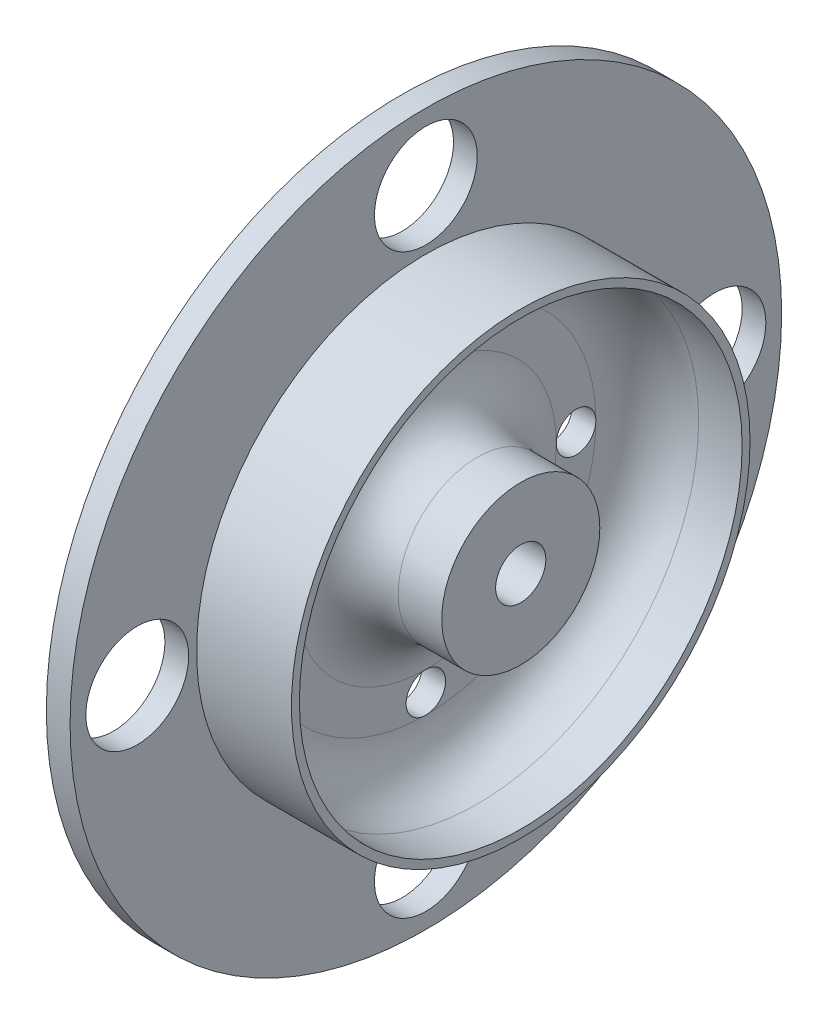
ISO-10303-21;
HEADER;
FILE_DESCRIPTION(('STEP AP214'),'2;1');
FILE_NAME('part.step','',(''),(''),'','','');
FILE_SCHEMA(('AUTOMOTIVE_DESIGN { 1 0 10303 214 1 1 1 1 }'));
ENDSEC;
DATA;
#1=APPLICATION_CONTEXT('core data for automotive mechanical design processes');
#2=APPLICATION_PROTOCOL_DEFINITION('international standard','automotive_design',2000,#1);
#3=PRODUCT_CONTEXT('',#1,'mechanical');
#4=PRODUCT('Part','Part','',(#3));
#5=PRODUCT_RELATED_PRODUCT_CATEGORY('part','',(#4));
#6=PRODUCT_DEFINITION_FORMATION('','',#4);
#7=PRODUCT_DEFINITION_CONTEXT('part definition',#1,'design');
#8=PRODUCT_DEFINITION('design','',#6,#7);
#9=PRODUCT_DEFINITION_SHAPE('','',#8);
#10=(LENGTH_UNIT() NAMED_UNIT(*) SI_UNIT(.MILLI.,.METRE.));
#11=(NAMED_UNIT(*) PLANE_ANGLE_UNIT() SI_UNIT($,.RADIAN.));
#12=(NAMED_UNIT(*) SI_UNIT($,.STERADIAN.) SOLID_ANGLE_UNIT());
#13=UNCERTAINTY_MEASURE_WITH_UNIT(LENGTH_MEASURE(1.E-05),#10,'distance_accuracy_value','');
#14=(GEOMETRIC_REPRESENTATION_CONTEXT(3) GLOBAL_UNCERTAINTY_ASSIGNED_CONTEXT((#13)) GLOBAL_UNIT_ASSIGNED_CONTEXT((#10,
#11,#12)) REPRESENTATION_CONTEXT('',''));
#15=CARTESIAN_POINT('',(0.,0.,0.));
#16=DIRECTION('',(0.,0.,1.));
#17=DIRECTION('',(1.,0.,0.));
#18=AXIS2_PLACEMENT_3D('',#15,#16,#17);
#19=CARTESIAN_POINT('',(3.0475130098464,0.,0.));
#20=DIRECTION('',(1.,0.,0.));
#21=DIRECTION('',(0.,0.,-1.));
#22=AXIS2_PLACEMENT_3D('',#19,#20,#21);
#23=PLANE('',#22);
#24=CARTESIAN_POINT('',(3.0475130098464,0.,16.8888888888889));
#25=DIRECTION('',(1.,0.,0.));
#26=DIRECTION('',(0.,0.,-1.));
#27=AXIS2_PLACEMENT_3D('',#24,#25,#26);
#28=CIRCLE('',#27,2.22222222222222);
#29=CARTESIAN_POINT('',(3.0475130098464,0.,14.6666666666667));
#30=VERTEX_POINT('',#29);
#31=CARTESIAN_POINT('',(3.0475130098464,0.,19.1111111111111));
#32=VERTEX_POINT('',#31);
#33=EDGE_CURVE('E55',#30,#32,#28,.T.);
#34=ORIENTED_EDGE('',*,*,#33,.F.);
#35=CARTESIAN_POINT('',(3.0475130098464,0.,0.));
#36=DIRECTION('',(1.,0.,0.));
#37=DIRECTION('',(0.,0.,-1.));
#38=AXIS2_PLACEMENT_3D('',#35,#36,#37);
#39=CIRCLE('',#38,14.6666666666667);
#40=CARTESIAN_POINT('',(3.0475130098464,14.6666666666667,0.));
#41=VERTEX_POINT('',#40);
#42=EDGE_CURVE('E89',#30,#41,#39,.F.);
#43=ORIENTED_EDGE('',*,*,#42,.T.);
#44=CARTESIAN_POINT('',(3.0475130098464,16.8888888888889,0.));
#45=DIRECTION('',(1.,0.,0.));
#46=DIRECTION('',(0.,0.,-1.));
#47=AXIS2_PLACEMENT_3D('',#44,#45,#46);
#48=CIRCLE('',#47,2.22222222222222);
#49=CARTESIAN_POINT('',(3.0475130098464,19.1111111111111,0.));
#50=VERTEX_POINT('',#49);
#51=EDGE_CURVE('E185',#50,#41,#48,.T.);
#52=ORIENTED_EDGE('',*,*,#51,.F.);
#53=CARTESIAN_POINT('',(3.0475130098464,0.,0.));
#54=DIRECTION('',(1.,0.,0.));
#55=DIRECTION('',(0.,0.,-1.));
#56=AXIS2_PLACEMENT_3D('',#53,#54,#55);
#57=CIRCLE('',#56,19.1111111111111);
#58=EDGE_CURVE('E92',#50,#32,#57,.T.);
#59=ORIENTED_EDGE('',*,*,#58,.T.);
#60=EDGE_LOOP('',(#34,#43,#52,#59));
#61=FACE_BOUND('',#60,.T.);
#62=ADVANCED_FACE('F40',(#61),#23,.T.);
#63=EDGE_CURVE('E80',#32,#30,#28,.T.);
#64=ORIENTED_EDGE('',*,*,#63,.F.);
#65=CARTESIAN_POINT('',(3.0475130098464,-19.1111111111111,0.));
#66=VERTEX_POINT('',#65);
#67=EDGE_CURVE('E62',#32,#66,#57,.T.);
#68=ORIENTED_EDGE('',*,*,#67,.T.);
#69=CARTESIAN_POINT('',(3.0475130098464,-16.8888888888889,0.));
#70=DIRECTION('',(1.,0.,0.));
#71=DIRECTION('',(0.,0.,-1.));
#72=AXIS2_PLACEMENT_3D('',#69,#70,#71);
#73=CIRCLE('',#72,2.22222222222222);
#74=CARTESIAN_POINT('',(3.0475130098464,-14.6666666666667,0.));
#75=VERTEX_POINT('',#74);
#76=EDGE_CURVE('E106',#75,#66,#73,.T.);
#77=ORIENTED_EDGE('',*,*,#76,.F.);
#78=EDGE_CURVE('E101',#75,#30,#39,.F.);
#79=ORIENTED_EDGE('',*,*,#78,.T.);
#80=EDGE_LOOP('',(#64,#68,#77,#79));
#81=FACE_BOUND('',#80,.T.);
#82=ADVANCED_FACE('F105',(#81),#23,.T.);
#83=CARTESIAN_POINT('',(3.0475130098464,0.,-16.8888888888889));
#84=DIRECTION('',(1.,0.,0.));
#85=DIRECTION('',(0.,0.,-1.));
#86=AXIS2_PLACEMENT_3D('',#83,#84,#85);
#87=CIRCLE('',#86,2.22222222222222);
#88=CARTESIAN_POINT('',(3.0475130098464,0.,-19.1111111111111));
#89=VERTEX_POINT('',#88);
#90=CARTESIAN_POINT('',(3.0475130098464,0.,-14.6666666666667));
#91=VERTEX_POINT('',#90);
#92=EDGE_CURVE('E192',#89,#91,#87,.T.);
#93=ORIENTED_EDGE('',*,*,#92,.F.);
#94=EDGE_CURVE('E115',#89,#50,#57,.T.);
#95=ORIENTED_EDGE('',*,*,#94,.T.);
#96=EDGE_CURVE('E188',#41,#50,#48,.T.);
#97=ORIENTED_EDGE('',*,*,#96,.F.);
#98=EDGE_CURVE('E49',#41,#91,#39,.F.);
#99=ORIENTED_EDGE('',*,*,#98,.T.);
#100=EDGE_LOOP('',(#93,#95,#97,#99));
#101=FACE_BOUND('',#100,.T.);
#102=ADVANCED_FACE('F230',(#101),#23,.T.);
#103=CARTESIAN_POINT('',(3.0475130098464,0.,0.));
#104=DIRECTION('',(-1.,0.,0.));
#105=DIRECTION('',(0.,0.,1.));
#106=AXIS2_PLACEMENT_3D('',#103,#104,#105);
#107=CYLINDRICAL_SURFACE('',#106,40.);
#108=CARTESIAN_POINT('',(3.0475130098464,0.,0.));
#109=DIRECTION('',(1.,0.,0.));
#110=DIRECTION('',(0.,0.,-1.));
#111=AXIS2_PLACEMENT_3D('',#108,#109,#110);
#112=CIRCLE('',#111,40.);
#113=CARTESIAN_POINT('',(3.0475130098464,0.,-40.));
#114=VERTEX_POINT('',#113);
#115=EDGE_CURVE('E120',#114,#114,#112,.T.);
#116=ORIENTED_EDGE('',*,*,#115,.F.);
#117=EDGE_LOOP('',(#116));
#118=FACE_BOUND('',#117,.T.);
#119=CARTESIAN_POINT('',(0.380846343179729,0.,0.));
#120=DIRECTION('',(1.,0.,0.));
#121=DIRECTION('',(0.,0.,-1.));
#122=AXIS2_PLACEMENT_3D('',#119,#120,#121);
#123=CIRCLE('',#122,40.);
#124=CARTESIAN_POINT('',(0.380846343179729,0.,-40.));
#125=VERTEX_POINT('',#124);
#126=EDGE_CURVE('E121',#125,#125,#123,.T.);
#127=ORIENTED_EDGE('',*,*,#126,.T.);
#128=EDGE_LOOP('',(#127));
#129=FACE_BOUND('',#128,.T.);
#130=ADVANCED_FACE('F260',(#118,#129),#107,.T.);
#131=CARTESIAN_POINT('',(3.0475130098464,0.,32.4444444444444));
#132=DIRECTION('',(1.,0.,0.));
#133=DIRECTION('',(0.,0.,-1.));
#134=AXIS2_PLACEMENT_3D('',#131,#132,#133);
#135=CIRCLE('',#134,5.77777777777778);
#136=CARTESIAN_POINT('',(3.0475130098464,0.,26.6666666666667));
#137=VERTEX_POINT('',#136);
#138=EDGE_CURVE('E177',#137,#137,#135,.T.);
#139=ORIENTED_EDGE('',*,*,#138,.F.);
#140=EDGE_LOOP('',(#139));
#141=FACE_BOUND('',#140,.T.);
#142=CARTESIAN_POINT('',(3.0475130098464,-32.4444444444444,0.));
#143=DIRECTION('',(1.,0.,0.));
#144=DIRECTION('',(0.,0.,-1.));
#145=AXIS2_PLACEMENT_3D('',#142,#143,#144);
#146=CIRCLE('',#145,5.77777777777778);
#147=CARTESIAN_POINT('',(3.0475130098464,-32.4444444444444,-5.77777777777779));
#148=VERTEX_POINT('',#147);
#149=EDGE_CURVE('E169',#148,#148,#146,.T.);
#150=ORIENTED_EDGE('',*,*,#149,.F.);
#151=EDGE_LOOP('',(#150));
#152=FACE_BOUND('',#151,.T.);
#153=CARTESIAN_POINT('',(3.0475130098464,0.,-32.4444444444444));
#154=DIRECTION('',(1.,0.,0.));
#155=DIRECTION('',(0.,0.,-1.));
#156=AXIS2_PLACEMENT_3D('',#153,#154,#155);
#157=CIRCLE('',#156,5.77777777777778);
#158=CARTESIAN_POINT('',(3.0475130098464,0.,-38.2222222222222));
#159=VERTEX_POINT('',#158);
#160=EDGE_CURVE('E161',#159,#159,#157,.T.);
#161=ORIENTED_EDGE('',*,*,#160,.F.);
#162=EDGE_LOOP('',(#161));
#163=FACE_BOUND('',#162,.T.);
#164=CARTESIAN_POINT('',(3.0475130098464,32.4444444444444,0.));
#165=DIRECTION('',(1.,0.,0.));
#166=DIRECTION('',(0.,0.,-1.));
#167=AXIS2_PLACEMENT_3D('',#164,#165,#166);
#168=CIRCLE('',#167,5.77777777777778);
#169=CARTESIAN_POINT('',(3.0475130098464,32.4444444444444,-5.77777777777778));
#170=VERTEX_POINT('',#169);
#171=EDGE_CURVE('E153',#170,#170,#168,.T.);
#172=ORIENTED_EDGE('',*,*,#171,.F.);
#173=EDGE_LOOP('',(#172));
#174=FACE_BOUND('',#173,.T.);
#175=CARTESIAN_POINT('',(3.0475130098464,0.,0.));
#176=DIRECTION('',(1.,0.,0.));
#177=DIRECTION('',(0.,0.,-1.));
#178=AXIS2_PLACEMENT_3D('',#175,#176,#177);
#179=CIRCLE('',#178,25.7777777777778);
#180=CARTESIAN_POINT('',(3.0475130098464,0.,-25.7777777777778));
#181=VERTEX_POINT('',#180);
#182=EDGE_CURVE('E133',#181,#181,#179,.T.);
#183=ORIENTED_EDGE('',*,*,#182,.F.);
#184=EDGE_LOOP('',(#183));
#185=FACE_BOUND('',#184,.T.);
#186=ORIENTED_EDGE('',*,*,#115,.T.);
#187=EDGE_LOOP('',(#186));
#188=FACE_BOUND('',#187,.T.);
#189=ADVANCED_FACE('F252',(#141,#152,#163,#174,#185,#188),#23,.T.);
#190=CARTESIAN_POINT('',(0.380846343179729,0.,0.));
#191=DIRECTION('',(1.,0.,0.));
#192=DIRECTION('',(0.,0.,-1.));
#193=AXIS2_PLACEMENT_3D('',#190,#191,#192);
#194=PLANE('',#193);
#195=CARTESIAN_POINT('',(0.380846343179729,0.,16.8888888888889));
#196=DIRECTION('',(1.,0.,0.));
#197=DIRECTION('',(0.,0.,-1.));
#198=AXIS2_PLACEMENT_3D('',#195,#196,#197);
#199=CIRCLE('',#198,2.22222222222222);
#200=CARTESIAN_POINT('',(0.380846343179729,0.,14.6666666666667));
#201=VERTEX_POINT('',#200);
#202=EDGE_CURVE('E94',#201,#201,#199,.T.);
#203=ORIENTED_EDGE('',*,*,#202,.T.);
#204=EDGE_LOOP('',(#203));
#205=FACE_BOUND('',#204,.T.);
#206=CARTESIAN_POINT('',(0.380846343179729,-16.8888888888889,0.));
#207=DIRECTION('',(1.,0.,0.));
#208=DIRECTION('',(0.,0.,-1.));
#209=AXIS2_PLACEMENT_3D('',#206,#207,#208);
#210=CIRCLE('',#209,2.22222222222222);
#211=CARTESIAN_POINT('',(0.380846343179729,-16.8888888888889,-2.22222222222223));
#212=VERTEX_POINT('',#211);
#213=EDGE_CURVE('E201',#212,#212,#210,.T.);
#214=ORIENTED_EDGE('',*,*,#213,.T.);
#215=EDGE_LOOP('',(#214));
#216=FACE_BOUND('',#215,.T.);
#217=CARTESIAN_POINT('',(0.380846343179729,0.,-16.8888888888889));
#218=DIRECTION('',(1.,0.,0.));
#219=DIRECTION('',(0.,0.,-1.));
#220=AXIS2_PLACEMENT_3D('',#217,#218,#219);
#221=CIRCLE('',#220,2.22222222222222);
#222=CARTESIAN_POINT('',(0.380846343179729,0.,-19.1111111111111));
#223=VERTEX_POINT('',#222);
#224=EDGE_CURVE('E195',#223,#223,#221,.T.);
#225=ORIENTED_EDGE('',*,*,#224,.T.);
#226=EDGE_LOOP('',(#225));
#227=FACE_BOUND('',#226,.T.);
#228=CARTESIAN_POINT('',(0.380846343179729,16.8888888888889,0.));
#229=DIRECTION('',(1.,0.,0.));
#230=DIRECTION('',(0.,0.,-1.));
#231=AXIS2_PLACEMENT_3D('',#228,#229,#230);
#232=CIRCLE('',#231,2.22222222222222);
#233=CARTESIAN_POINT('',(0.380846343179729,16.8888888888889,-2.22222222222222));
#234=VERTEX_POINT('',#233);
#235=EDGE_CURVE('E181',#234,#234,#232,.T.);
#236=ORIENTED_EDGE('',*,*,#235,.T.);
#237=EDGE_LOOP('',(#236));
#238=FACE_BOUND('',#237,.T.);
#239=CARTESIAN_POINT('',(0.380846343179729,0.,32.4444444444444));
#240=DIRECTION('',(1.,0.,0.));
#241=DIRECTION('',(0.,0.,-1.));
#242=AXIS2_PLACEMENT_3D('',#239,#240,#241);
#243=CIRCLE('',#242,5.77777777777778);
#244=CARTESIAN_POINT('',(0.380846343179729,0.,26.6666666666667));
#245=VERTEX_POINT('',#244);
#246=EDGE_CURVE('E173',#245,#245,#243,.T.);
#247=ORIENTED_EDGE('',*,*,#246,.T.);
#248=EDGE_LOOP('',(#247));
#249=FACE_BOUND('',#248,.T.);
#250=CARTESIAN_POINT('',(0.380846343179729,-32.4444444444444,0.));
#251=DIRECTION('',(1.,0.,0.));
#252=DIRECTION('',(0.,0.,-1.));
#253=AXIS2_PLACEMENT_3D('',#250,#251,#252);
#254=CIRCLE('',#253,5.77777777777778);
#255=CARTESIAN_POINT('',(0.380846343179729,-32.4444444444444,-5.77777777777779));
#256=VERTEX_POINT('',#255);
#257=EDGE_CURVE('E165',#256,#256,#254,.T.);
#258=ORIENTED_EDGE('',*,*,#257,.T.);
#259=EDGE_LOOP('',(#258));
#260=FACE_BOUND('',#259,.T.);
#261=CARTESIAN_POINT('',(0.380846343179729,0.,-32.4444444444444));
#262=DIRECTION('',(1.,0.,0.));
#263=DIRECTION('',(0.,0.,-1.));
#264=AXIS2_PLACEMENT_3D('',#261,#262,#263);
#265=CIRCLE('',#264,5.77777777777778);
#266=CARTESIAN_POINT('',(0.380846343179729,0.,-38.2222222222222));
#267=VERTEX_POINT('',#266);
#268=EDGE_CURVE('E157',#267,#267,#265,.T.);
#269=ORIENTED_EDGE('',*,*,#268,.T.);
#270=EDGE_LOOP('',(#269));
#271=FACE_BOUND('',#270,.T.);
#272=CARTESIAN_POINT('',(0.380846343179729,32.4444444444444,0.));
#273=DIRECTION('',(1.,0.,0.));
#274=DIRECTION('',(0.,0.,-1.));
#275=AXIS2_PLACEMENT_3D('',#272,#273,#274);
#276=CIRCLE('',#275,5.77777777777778);
#277=CARTESIAN_POINT('',(0.380846343179729,32.4444444444444,-5.77777777777778));
#278=VERTEX_POINT('',#277);
#279=EDGE_CURVE('E152',#278,#278,#276,.T.);
#280=ORIENTED_EDGE('',*,*,#279,.T.);
#281=EDGE_LOOP('',(#280));
#282=FACE_BOUND('',#281,.T.);
#283=CARTESIAN_POINT('',(0.380846343179729,0.,0.));
#284=DIRECTION('',(1.,0.,0.));
#285=DIRECTION('',(0.,0.,-1.));
#286=AXIS2_PLACEMENT_3D('',#283,#284,#285);
#287=CIRCLE('',#286,2.82222222222222);
#288=CARTESIAN_POINT('',(0.380846343179729,0.,-2.82222222222222));
#289=VERTEX_POINT('',#288);
#290=EDGE_CURVE('E144',#289,#289,#287,.F.);
#291=ORIENTED_EDGE('',*,*,#290,.F.);
#292=EDGE_LOOP('',(#291));
#293=FACE_BOUND('',#292,.T.);
#294=ORIENTED_EDGE('',*,*,#126,.F.);
#295=EDGE_LOOP('',(#294));
#296=FACE_BOUND('',#295,.T.);
#297=ADVANCED_FACE('F259',(#205,#216,#227,#238,#249,#260,#271,#282,#293,#296),#194,.F.);
#298=CARTESIAN_POINT('',(13.7141796765131,0.,0.));
#299=DIRECTION('',(1.,0.,0.));
#300=DIRECTION('',(0.,0.,-1.));
#301=AXIS2_PLACEMENT_3D('',#298,#299,#300);
#302=PLANE('',#301);
#303=CARTESIAN_POINT('',(13.7141796765131,0.,0.));
#304=DIRECTION('',(1.,0.,0.));
#305=DIRECTION('',(0.,0.,-1.));
#306=AXIS2_PLACEMENT_3D('',#303,#304,#305);
#307=CIRCLE('',#306,25.7777777777778);
#308=CARTESIAN_POINT('',(13.7141796765131,0.,-25.7777777777778));
#309=VERTEX_POINT('',#308);
#310=EDGE_CURVE('E132',#309,#309,#307,.T.);
#311=ORIENTED_EDGE('',*,*,#310,.T.);
#312=EDGE_LOOP('',(#311));
#313=FACE_BOUND('',#312,.T.);
#314=CARTESIAN_POINT('',(13.7141796765131,0.,0.));
#315=DIRECTION('',(1.,0.,0.));
#316=DIRECTION('',(0.,0.,-1.));
#317=AXIS2_PLACEMENT_3D('',#314,#315,#316);
#318=CIRCLE('',#317,24.8888888888889);
#319=CARTESIAN_POINT('',(13.7141796765131,0.,-24.8888888888889));
#320=VERTEX_POINT('',#319);
#321=EDGE_CURVE('E137',#320,#320,#318,.T.);
#322=ORIENTED_EDGE('',*,*,#321,.F.);
#323=EDGE_LOOP('',(#322));
#324=FACE_BOUND('',#323,.T.);
#325=ADVANCED_FACE('F266',(#313,#324),#302,.T.);
#326=CARTESIAN_POINT('',(13.7141796765131,0.,0.));
#327=DIRECTION('',(-1.,0.,0.));
#328=DIRECTION('',(0.,0.,1.));
#329=AXIS2_PLACEMENT_3D('',#326,#327,#328);
#330=CYLINDRICAL_SURFACE('',#329,25.7777777777778);
#331=ORIENTED_EDGE('',*,*,#310,.F.);
#332=EDGE_LOOP('',(#331));
#333=FACE_BOUND('',#332,.T.);
#334=ORIENTED_EDGE('',*,*,#182,.T.);
#335=EDGE_LOOP('',(#334));
#336=FACE_BOUND('',#335,.T.);
#337=ADVANCED_FACE('F305',(#333,#336),#330,.T.);
#338=CARTESIAN_POINT('',(13.7141796765131,0.,0.));
#339=DIRECTION('',(-1.,0.,0.));
#340=DIRECTION('',(0.,0.,1.));
#341=AXIS2_PLACEMENT_3D('',#338,#339,#340);
#342=CYLINDRICAL_SURFACE('',#341,24.8888888888889);
#343=CARTESIAN_POINT('',(8.82529078762417,0.,0.));
#344=DIRECTION('',(1.,0.,0.));
#345=DIRECTION('',(0.,0.,-1.));
#346=AXIS2_PLACEMENT_3D('',#343,#344,#345);
#347=CIRCLE('',#346,24.8888888888889);
#348=CARTESIAN_POINT('',(8.82529078762417,0.,-24.8888888888889));
#349=VERTEX_POINT('',#348);
#350=EDGE_CURVE('E11',#349,#349,#347,.F.);
#351=ORIENTED_EDGE('',*,*,#350,.T.);
#352=EDGE_LOOP('',(#351));
#353=FACE_BOUND('',#352,.T.);
#354=ORIENTED_EDGE('',*,*,#321,.T.);
#355=EDGE_LOOP('',(#354));
#356=FACE_BOUND('',#355,.T.);
#357=ADVANCED_FACE('F314',(#353,#356),#342,.F.);
#358=CARTESIAN_POINT('',(13.7141796765131,0.,0.));
#359=DIRECTION('',(1.,0.,0.));
#360=DIRECTION('',(0.,0.,-1.));
#361=AXIS2_PLACEMENT_3D('',#358,#359,#360);
#362=PLANE('',#361);
#363=CARTESIAN_POINT('',(13.7141796765131,0.,0.));
#364=DIRECTION('',(1.,0.,0.));
#365=DIRECTION('',(0.,0.,-1.));
#366=AXIS2_PLACEMENT_3D('',#363,#364,#365);
#367=CIRCLE('',#366,2.82222222222222);
#368=CARTESIAN_POINT('',(13.7141796765131,0.,-2.82222222222222));
#369=VERTEX_POINT('',#368);
#370=EDGE_CURVE('E148',#369,#369,#367,.T.);
#371=ORIENTED_EDGE('',*,*,#370,.F.);
#372=EDGE_LOOP('',(#371));
#373=FACE_BOUND('',#372,.T.);
#374=CARTESIAN_POINT('',(13.7141796765131,0.,0.));
#375=DIRECTION('',(1.,0.,0.));
#376=DIRECTION('',(0.,0.,-1.));
#377=AXIS2_PLACEMENT_3D('',#374,#375,#376);
#378=CIRCLE('',#377,8.88888888888889);
#379=CARTESIAN_POINT('',(13.7141796765131,0.,-8.88888888888889));
#380=VERTEX_POINT('',#379);
#381=EDGE_CURVE('E125',#380,#380,#378,.T.);
#382=ORIENTED_EDGE('',*,*,#381,.T.);
#383=EDGE_LOOP('',(#382));
#384=FACE_BOUND('',#383,.T.);
#385=ADVANCED_FACE('F280',(#373,#384),#362,.T.);
#386=CARTESIAN_POINT('',(13.7141796765131,0.,0.));
#387=DIRECTION('',(-1.,0.,0.));
#388=DIRECTION('',(0.,0.,1.));
#389=AXIS2_PLACEMENT_3D('',#386,#387,#388);
#390=CYLINDRICAL_SURFACE('',#389,8.88888888888889);
#391=CARTESIAN_POINT('',(8.82529078762417,0.,0.));
#392=DIRECTION('',(1.,0.,0.));
#393=DIRECTION('',(0.,0.,-1.));
#394=AXIS2_PLACEMENT_3D('',#391,#392,#393);
#395=CIRCLE('',#394,8.88888888888889);
#396=CARTESIAN_POINT('',(8.82529078762417,0.,-8.88888888888889));
#397=VERTEX_POINT('',#396);
#398=EDGE_CURVE('E116',#397,#397,#395,.T.);
#399=ORIENTED_EDGE('',*,*,#398,.T.);
#400=EDGE_LOOP('',(#399));
#401=FACE_BOUND('',#400,.T.);
#402=ORIENTED_EDGE('',*,*,#381,.F.);
#403=EDGE_LOOP('',(#402));
#404=FACE_BOUND('',#403,.T.);
#405=ADVANCED_FACE('F273',(#401,#404),#390,.T.);
#406=EDGE_CURVE('E202',#66,#75,#73,.T.);
#407=ORIENTED_EDGE('',*,*,#406,.F.);
#408=EDGE_CURVE('E218',#66,#89,#57,.T.);
#409=ORIENTED_EDGE('',*,*,#408,.T.);
#410=EDGE_CURVE('E196',#91,#89,#87,.T.);
#411=ORIENTED_EDGE('',*,*,#410,.F.);
#412=EDGE_CURVE('E108',#91,#75,#39,.F.);
#413=ORIENTED_EDGE('',*,*,#412,.T.);
#414=EDGE_LOOP('',(#407,#409,#411,#413));
#415=FACE_BOUND('',#414,.T.);
#416=ADVANCED_FACE('F216',(#415),#23,.T.);
#417=CARTESIAN_POINT('',(-7.60160354221507,0.,0.));
#418=DIRECTION('',(1.,0.,0.));
#419=DIRECTION('',(0.,0.,-1.));
#420=AXIS2_PLACEMENT_3D('',#417,#418,#419);
#421=CYLINDRICAL_SURFACE('',#420,2.82222222222222);
#422=ORIENTED_EDGE('',*,*,#290,.T.);
#423=EDGE_LOOP('',(#422));
#424=FACE_BOUND('',#423,.T.);
#425=ORIENTED_EDGE('',*,*,#370,.T.);
#426=EDGE_LOOP('',(#425));
#427=FACE_BOUND('',#426,.T.);
#428=ADVANCED_FACE('F272',(#424,#427),#421,.F.);
#429=CARTESIAN_POINT('',(8.82529078762417,0.,0.));
#430=DIRECTION('',(1.,0.,0.));
#431=DIRECTION('',(0.,0.,-1.));
#432=AXIS2_PLACEMENT_3D('',#429,#430,#431);
#433=TOROIDAL_SURFACE('',#432,14.6666666666667,5.77777777777778);
#434=ORIENTED_EDGE('',*,*,#98,.F.);
#435=ORIENTED_EDGE('',*,*,#42,.F.);
#436=ORIENTED_EDGE('',*,*,#78,.F.);
#437=ORIENTED_EDGE('',*,*,#412,.F.);
#438=EDGE_LOOP('',(#434,#435,#436,#437));
#439=FACE_BOUND('',#438,.T.);
#440=ORIENTED_EDGE('',*,*,#398,.F.);
#441=EDGE_LOOP('',(#440));
#442=FACE_BOUND('',#441,.T.);
#443=ADVANCED_FACE('F98',(#439,#442),#433,.F.);
#444=CARTESIAN_POINT('',(8.82529078762417,0.,0.));
#445=DIRECTION('',(1.,0.,0.));
#446=DIRECTION('',(0.,0.,-1.));
#447=AXIS2_PLACEMENT_3D('',#444,#445,#446);
#448=TOROIDAL_SURFACE('',#447,19.1111111111111,5.77777777777778);
#449=ORIENTED_EDGE('',*,*,#58,.F.);
#450=ORIENTED_EDGE('',*,*,#94,.F.);
#451=ORIENTED_EDGE('',*,*,#408,.F.);
#452=ORIENTED_EDGE('',*,*,#67,.F.);
#453=EDGE_LOOP('',(#449,#450,#451,#452));
#454=FACE_BOUND('',#453,.T.);
#455=ORIENTED_EDGE('',*,*,#350,.F.);
#456=EDGE_LOOP('',(#455));
#457=FACE_BOUND('',#456,.T.);
#458=ADVANCED_FACE('F42',(#454,#457),#448,.F.);
#459=CARTESIAN_POINT('',(0.380846343179729,32.4444444444444,0.));
#460=DIRECTION('',(1.,0.,0.));
#461=DIRECTION('',(0.,0.,-1.));
#462=AXIS2_PLACEMENT_3D('',#459,#460,#461);
#463=CYLINDRICAL_SURFACE('',#462,5.77777777777778);
#464=ORIENTED_EDGE('',*,*,#279,.F.);
#465=EDGE_LOOP('',(#464));
#466=FACE_BOUND('',#465,.T.);
#467=ORIENTED_EDGE('',*,*,#171,.T.);
#468=EDGE_LOOP('',(#467));
#469=FACE_BOUND('',#468,.T.);
#470=ADVANCED_FACE('F358',(#466,#469),#463,.F.);
#471=CARTESIAN_POINT('',(0.380846343179729,0.,-32.4444444444444));
#472=DIRECTION('',(1.,0.,0.));
#473=DIRECTION('',(0.,0.,-1.));
#474=AXIS2_PLACEMENT_3D('',#471,#472,#473);
#475=CYLINDRICAL_SURFACE('',#474,5.77777777777778);
#476=ORIENTED_EDGE('',*,*,#268,.F.);
#477=EDGE_LOOP('',(#476));
#478=FACE_BOUND('',#477,.T.);
#479=ORIENTED_EDGE('',*,*,#160,.T.);
#480=EDGE_LOOP('',(#479));
#481=FACE_BOUND('',#480,.T.);
#482=ADVANCED_FACE('F365',(#478,#481),#475,.F.);
#483=CARTESIAN_POINT('',(0.380846343179729,-32.4444444444444,0.));
#484=DIRECTION('',(1.,0.,0.));
#485=DIRECTION('',(0.,0.,-1.));
#486=AXIS2_PLACEMENT_3D('',#483,#484,#485);
#487=CYLINDRICAL_SURFACE('',#486,5.77777777777778);
#488=ORIENTED_EDGE('',*,*,#257,.F.);
#489=EDGE_LOOP('',(#488));
#490=FACE_BOUND('',#489,.T.);
#491=ORIENTED_EDGE('',*,*,#149,.T.);
#492=EDGE_LOOP('',(#491));
#493=FACE_BOUND('',#492,.T.);
#494=ADVANCED_FACE('F374',(#490,#493),#487,.F.);
#495=CARTESIAN_POINT('',(0.380846343179729,0.,32.4444444444444));
#496=DIRECTION('',(1.,0.,0.));
#497=DIRECTION('',(0.,0.,-1.));
#498=AXIS2_PLACEMENT_3D('',#495,#496,#497);
#499=CYLINDRICAL_SURFACE('',#498,5.77777777777778);
#500=ORIENTED_EDGE('',*,*,#246,.F.);
#501=EDGE_LOOP('',(#500));
#502=FACE_BOUND('',#501,.T.);
#503=ORIENTED_EDGE('',*,*,#138,.T.);
#504=EDGE_LOOP('',(#503));
#505=FACE_BOUND('',#504,.T.);
#506=ADVANCED_FACE('F246',(#502,#505),#499,.F.);
#507=CARTESIAN_POINT('',(0.380846343179729,16.8888888888889,0.));
#508=DIRECTION('',(1.,0.,0.));
#509=DIRECTION('',(0.,0.,-1.));
#510=AXIS2_PLACEMENT_3D('',#507,#508,#509);
#511=CYLINDRICAL_SURFACE('',#510,2.22222222222222);
#512=ORIENTED_EDGE('',*,*,#235,.F.);
#513=EDGE_LOOP('',(#512));
#514=FACE_BOUND('',#513,.T.);
#515=ORIENTED_EDGE('',*,*,#51,.T.);
#516=ORIENTED_EDGE('',*,*,#96,.T.);
#517=EDGE_LOOP('',(#515,#516));
#518=FACE_BOUND('',#517,.T.);
#519=ADVANCED_FACE('F232',(#514,#518),#511,.F.);
#520=CARTESIAN_POINT('',(0.380846343179729,0.,-16.8888888888889));
#521=DIRECTION('',(1.,0.,0.));
#522=DIRECTION('',(0.,0.,-1.));
#523=AXIS2_PLACEMENT_3D('',#520,#521,#522);
#524=CYLINDRICAL_SURFACE('',#523,2.22222222222222);
#525=ORIENTED_EDGE('',*,*,#224,.F.);
#526=EDGE_LOOP('',(#525));
#527=FACE_BOUND('',#526,.T.);
#528=ORIENTED_EDGE('',*,*,#92,.T.);
#529=ORIENTED_EDGE('',*,*,#410,.T.);
#530=EDGE_LOOP('',(#528,#529));
#531=FACE_BOUND('',#530,.T.);
#532=ADVANCED_FACE('F236',(#527,#531),#524,.F.);
#533=CARTESIAN_POINT('',(0.380846343179729,-16.8888888888889,0.));
#534=DIRECTION('',(1.,0.,0.));
#535=DIRECTION('',(0.,0.,-1.));
#536=AXIS2_PLACEMENT_3D('',#533,#534,#535);
#537=CYLINDRICAL_SURFACE('',#536,2.22222222222222);
#538=ORIENTED_EDGE('',*,*,#213,.F.);
#539=EDGE_LOOP('',(#538));
#540=FACE_BOUND('',#539,.T.);
#541=ORIENTED_EDGE('',*,*,#76,.T.);
#542=ORIENTED_EDGE('',*,*,#406,.T.);
#543=EDGE_LOOP('',(#541,#542));
#544=FACE_BOUND('',#543,.T.);
#545=ADVANCED_FACE('F213',(#540,#544),#537,.F.);
#546=CARTESIAN_POINT('',(0.380846343179729,0.,16.8888888888889));
#547=DIRECTION('',(1.,0.,0.));
#548=DIRECTION('',(0.,0.,-1.));
#549=AXIS2_PLACEMENT_3D('',#546,#547,#548);
#550=CYLINDRICAL_SURFACE('',#549,2.22222222222222);
#551=ORIENTED_EDGE('',*,*,#202,.F.);
#552=EDGE_LOOP('',(#551));
#553=FACE_BOUND('',#552,.T.);
#554=ORIENTED_EDGE('',*,*,#33,.T.);
#555=ORIENTED_EDGE('',*,*,#63,.T.);
#556=EDGE_LOOP('',(#554,#555));
#557=FACE_BOUND('',#556,.T.);
#558=ADVANCED_FACE('F81',(#553,#557),#550,.F.);
#559=CLOSED_SHELL('',(#62,#82,#102,#130,#189,#297,#325,#337,#357,#385,#405,#416,#428,#443,#458,
#470,#482,#494,#506,#519,#532,#545,#558));
#560=MANIFOLD_SOLID_BREP('B2',#559);
#561=ADVANCED_BREP_SHAPE_REPRESENTATION('',(#18,#560),#14);
#562=SHAPE_DEFINITION_REPRESENTATION(#9,#561);
ENDSEC;
END-ISO-10303-21;
